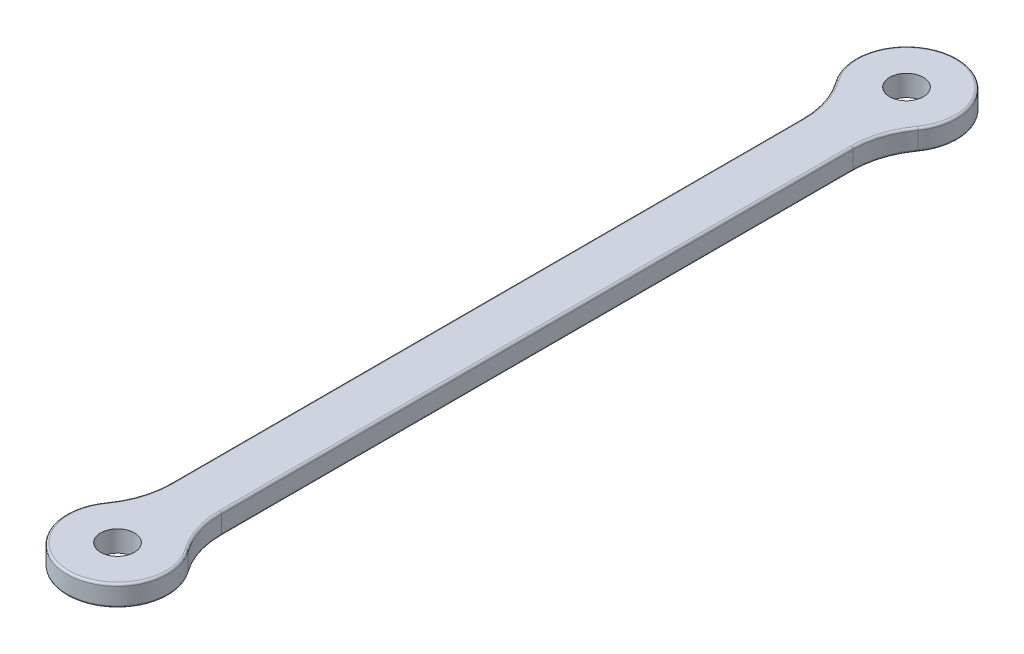
ISO-10303-21;
HEADER;
FILE_DESCRIPTION(('STEP AP214'),'2;1');
FILE_NAME('part.step','',(''),(''),'','','');
FILE_SCHEMA(('AUTOMOTIVE_DESIGN { 1 0 10303 214 1 1 1 1 }'));
ENDSEC;
DATA;
#1=APPLICATION_CONTEXT('core data for automotive mechanical design processes');
#2=APPLICATION_PROTOCOL_DEFINITION('international standard','automotive_design',2000,#1);
#3=PRODUCT_CONTEXT('',#1,'mechanical');
#4=PRODUCT('Part','Part','',(#3));
#5=PRODUCT_RELATED_PRODUCT_CATEGORY('part','',(#4));
#6=PRODUCT_DEFINITION_FORMATION('','',#4);
#7=PRODUCT_DEFINITION_CONTEXT('part definition',#1,'design');
#8=PRODUCT_DEFINITION('design','',#6,#7);
#9=PRODUCT_DEFINITION_SHAPE('','',#8);
#10=(LENGTH_UNIT() NAMED_UNIT(*) SI_UNIT(.MILLI.,.METRE.));
#11=(NAMED_UNIT(*) PLANE_ANGLE_UNIT() SI_UNIT($,.RADIAN.));
#12=(NAMED_UNIT(*) SI_UNIT($,.STERADIAN.) SOLID_ANGLE_UNIT());
#13=UNCERTAINTY_MEASURE_WITH_UNIT(LENGTH_MEASURE(1.E-05),#10,'distance_accuracy_value','');
#14=(GEOMETRIC_REPRESENTATION_CONTEXT(3) GLOBAL_UNCERTAINTY_ASSIGNED_CONTEXT((#13)) GLOBAL_UNIT_ASSIGNED_CONTEXT((#10,
#11,#12)) REPRESENTATION_CONTEXT('',''));
#15=CARTESIAN_POINT('',(0.,0.,0.));
#16=DIRECTION('',(0.,0.,1.));
#17=DIRECTION('',(1.,0.,0.));
#18=AXIS2_PLACEMENT_3D('',#15,#16,#17);
#19=CARTESIAN_POINT('',(0.,2.5,46.75));
#20=DIRECTION('',(0.,-1.,0.));
#21=DIRECTION('',(0.,0.,-1.));
#22=AXIS2_PLACEMENT_3D('',#19,#20,#21);
#23=CYLINDRICAL_SURFACE('',#22,6.);
#24=DIRECTION('',(0.,-1.,0.));
#25=VECTOR('',#24,1.);
#26=CARTESIAN_POINT('',(4.87500000000001,2.5,43.2522328550917));
#27=LINE('',#26,#25);
#28=CARTESIAN_POINT('',(4.87500000000001,0.25,43.2522328550917));
#29=VERTEX_POINT('',#28);
#30=CARTESIAN_POINT('',(4.87500000000001,2.25,43.2522328550917));
#31=VERTEX_POINT('',#30);
#32=EDGE_CURVE('E299',#29,#31,#27,.F.);
#33=ORIENTED_EDGE('',*,*,#32,.T.);
#34=CARTESIAN_POINT('',(0.,2.25,46.75));
#35=DIRECTION('',(0.,1.,0.));
#36=DIRECTION('',(0.,0.,1.));
#37=AXIS2_PLACEMENT_3D('',#34,#35,#36);
#38=CIRCLE('',#37,6.);
#39=CARTESIAN_POINT('',(-4.875,2.25,43.2522328550917));
#40=VERTEX_POINT('',#39);
#41=EDGE_CURVE('E193',#31,#40,#38,.F.);
#42=ORIENTED_EDGE('',*,*,#41,.T.);
#43=DIRECTION('',(0.,-1.,0.));
#44=VECTOR('',#43,1.);
#45=CARTESIAN_POINT('',(-4.875,2.5,43.2522328550917));
#46=LINE('',#45,#44);
#47=CARTESIAN_POINT('',(-4.875,0.25,43.2522328550917));
#48=VERTEX_POINT('',#47);
#49=EDGE_CURVE('E294',#40,#48,#46,.T.);
#50=ORIENTED_EDGE('',*,*,#49,.T.);
#51=CARTESIAN_POINT('',(0.,0.25,46.75));
#52=DIRECTION('',(0.,1.,0.));
#53=DIRECTION('',(0.,0.,1.));
#54=AXIS2_PLACEMENT_3D('',#51,#52,#53);
#55=CIRCLE('',#54,6.);
#56=EDGE_CURVE('E191',#48,#29,#55,.T.);
#57=ORIENTED_EDGE('',*,*,#56,.T.);
#58=EDGE_LOOP('',(#33,#42,#50,#57));
#59=FACE_BOUND('',#58,.T.);
#60=ADVANCED_FACE('F39',(#59),#23,.T.);
#61=CARTESIAN_POINT('',(3.,2.5,0.));
#62=DIRECTION('',(-1.,0.,0.));
#63=DIRECTION('',(0.,0.,1.));
#64=AXIS2_PLACEMENT_3D('',#61,#62,#63);
#65=PLANE('',#64);
#66=DIRECTION('',(0.,1.,0.));
#67=VECTOR('',#66,1.);
#68=CARTESIAN_POINT('',(3.,2.5,-37.4226209469112));
#69=LINE('',#68,#67);
#70=CARTESIAN_POINT('',(3.,0.25,-37.4226209469112));
#71=VERTEX_POINT('',#70);
#72=CARTESIAN_POINT('',(3.,2.25,-37.4226209469112));
#73=VERTEX_POINT('',#72);
#74=EDGE_CURVE('E175',#71,#73,#69,.T.);
#75=ORIENTED_EDGE('',*,*,#74,.T.);
#76=DIRECTION('',(0.,0.,-1.));
#77=VECTOR('',#76,1.);
#78=CARTESIAN_POINT('',(3.,2.25,37.4226209469112));
#79=LINE('',#78,#77);
#80=CARTESIAN_POINT('',(3.,2.25,37.4226209469112));
#81=VERTEX_POINT('',#80);
#82=EDGE_CURVE('E11',#73,#81,#79,.F.);
#83=ORIENTED_EDGE('',*,*,#82,.T.);
#84=DIRECTION('',(0.,1.,0.));
#85=VECTOR('',#84,1.);
#86=CARTESIAN_POINT('',(3.,0.,37.4226209469112));
#87=LINE('',#86,#85);
#88=CARTESIAN_POINT('',(3.,0.25,37.4226209469112));
#89=VERTEX_POINT('',#88);
#90=EDGE_CURVE('E306',#81,#89,#87,.F.);
#91=ORIENTED_EDGE('',*,*,#90,.T.);
#92=DIRECTION('',(0.,0.,-1.));
#93=VECTOR('',#92,1.);
#94=CARTESIAN_POINT('',(3.,0.25,0.));
#95=LINE('',#94,#93);
#96=EDGE_CURVE('E48',#89,#71,#95,.T.);
#97=ORIENTED_EDGE('',*,*,#96,.T.);
#98=EDGE_LOOP('',(#75,#83,#91,#97));
#99=FACE_BOUND('',#98,.T.);
#100=ADVANCED_FACE('F372',(#99),#65,.F.);
#101=CARTESIAN_POINT('',(0.,2.5,-46.75));
#102=DIRECTION('',(0.,-1.,0.));
#103=DIRECTION('',(0.,0.,-1.));
#104=AXIS2_PLACEMENT_3D('',#101,#102,#103);
#105=CYLINDRICAL_SURFACE('',#104,6.);
#106=DIRECTION('',(0.,-1.,0.));
#107=VECTOR('',#106,1.);
#108=CARTESIAN_POINT('',(-4.875,2.5,-43.2522328550917));
#109=LINE('',#108,#107);
#110=CARTESIAN_POINT('',(-4.875,0.25,-43.2522328550917));
#111=VERTEX_POINT('',#110);
#112=CARTESIAN_POINT('',(-4.875,2.25,-43.2522328550917));
#113=VERTEX_POINT('',#112);
#114=EDGE_CURVE('E287',#111,#113,#109,.F.);
#115=ORIENTED_EDGE('',*,*,#114,.T.);
#116=CARTESIAN_POINT('',(0.,2.25,-46.75));
#117=DIRECTION('',(0.,1.,0.));
#118=DIRECTION('',(0.,0.,1.));
#119=AXIS2_PLACEMENT_3D('',#116,#117,#118);
#120=CIRCLE('',#119,6.);
#121=CARTESIAN_POINT('',(4.87500000000001,2.25,-43.2522328550917));
#122=VERTEX_POINT('',#121);
#123=EDGE_CURVE('E209',#113,#122,#120,.F.);
#124=ORIENTED_EDGE('',*,*,#123,.T.);
#125=DIRECTION('',(0.,-1.,0.));
#126=VECTOR('',#125,1.);
#127=CARTESIAN_POINT('',(4.87500000000001,2.5,-43.2522328550917));
#128=LINE('',#127,#126);
#129=CARTESIAN_POINT('',(4.87500000000001,0.25,-43.2522328550917));
#130=VERTEX_POINT('',#129);
#131=EDGE_CURVE('E296',#122,#130,#128,.T.);
#132=ORIENTED_EDGE('',*,*,#131,.T.);
#133=CARTESIAN_POINT('',(0.,0.25,-46.75));
#134=DIRECTION('',(0.,1.,0.));
#135=DIRECTION('',(0.,0.,1.));
#136=AXIS2_PLACEMENT_3D('',#133,#134,#135);
#137=CIRCLE('',#136,6.);
#138=EDGE_CURVE('E207',#130,#111,#137,.T.);
#139=ORIENTED_EDGE('',*,*,#138,.T.);
#140=EDGE_LOOP('',(#115,#124,#132,#139));
#141=FACE_BOUND('',#140,.T.);
#142=ADVANCED_FACE('F377',(#141),#105,.T.);
#143=CARTESIAN_POINT('',(0.,2.5,46.75));
#144=DIRECTION('',(0.,-1.,0.));
#145=DIRECTION('',(0.,0.,-1.));
#146=AXIS2_PLACEMENT_3D('',#143,#144,#145);
#147=CYLINDRICAL_SURFACE('',#146,2.);
#148=CARTESIAN_POINT('',(0.,2.5,46.75));
#149=DIRECTION('',(0.,1.,0.));
#150=DIRECTION('',(0.,0.,1.));
#151=AXIS2_PLACEMENT_3D('',#148,#149,#150);
#152=CIRCLE('',#151,2.);
#153=CARTESIAN_POINT('',(0.,2.5,48.75));
#154=VERTEX_POINT('',#153);
#155=EDGE_CURVE('E337',#154,#154,#152,.T.);
#156=ORIENTED_EDGE('',*,*,#155,.T.);
#157=EDGE_LOOP('',(#156));
#158=FACE_BOUND('',#157,.T.);
#159=CARTESIAN_POINT('',(0.,0.,46.75));
#160=DIRECTION('',(0.,1.,0.));
#161=DIRECTION('',(0.,0.,1.));
#162=AXIS2_PLACEMENT_3D('',#159,#160,#161);
#163=CIRCLE('',#162,2.);
#164=CARTESIAN_POINT('',(0.,0.,48.75));
#165=VERTEX_POINT('',#164);
#166=EDGE_CURVE('E248',#165,#165,#163,.T.);
#167=ORIENTED_EDGE('',*,*,#166,.F.);
#168=EDGE_LOOP('',(#167));
#169=FACE_BOUND('',#168,.T.);
#170=ADVANCED_FACE('F348',(#158,#169),#147,.F.);
#171=CARTESIAN_POINT('',(-3.,2.5,0.));
#172=DIRECTION('',(-1.,0.,0.));
#173=DIRECTION('',(0.,0.,1.));
#174=AXIS2_PLACEMENT_3D('',#171,#172,#173);
#175=PLANE('',#174);
#176=DIRECTION('',(0.,-1.,0.));
#177=VECTOR('',#176,1.);
#178=CARTESIAN_POINT('',(-3.,2.5,37.4226209469112));
#179=LINE('',#178,#177);
#180=CARTESIAN_POINT('',(-3.,0.25,37.4226209469112));
#181=VERTEX_POINT('',#180);
#182=CARTESIAN_POINT('',(-3.,2.25,37.4226209469112));
#183=VERTEX_POINT('',#182);
#184=EDGE_CURVE('E293',#181,#183,#179,.F.);
#185=ORIENTED_EDGE('',*,*,#184,.T.);
#186=DIRECTION('',(0.,0.,-1.));
#187=VECTOR('',#186,1.);
#188=CARTESIAN_POINT('',(-3.,2.25,0.));
#189=LINE('',#188,#187);
#190=CARTESIAN_POINT('',(-3.,2.25,-37.4226209469112));
#191=VERTEX_POINT('',#190);
#192=EDGE_CURVE('E201',#183,#191,#189,.T.);
#193=ORIENTED_EDGE('',*,*,#192,.T.);
#194=DIRECTION('',(0.,-1.,0.));
#195=VECTOR('',#194,1.);
#196=CARTESIAN_POINT('',(-3.,2.5,-37.4226209469112));
#197=LINE('',#196,#195);
#198=CARTESIAN_POINT('',(-3.,0.25,-37.4226209469112));
#199=VERTEX_POINT('',#198);
#200=EDGE_CURVE('E284',#191,#199,#197,.T.);
#201=ORIENTED_EDGE('',*,*,#200,.T.);
#202=DIRECTION('',(0.,0.,-1.));
#203=VECTOR('',#202,1.);
#204=CARTESIAN_POINT('',(-3.,0.25,37.4226209469112));
#205=LINE('',#204,#203);
#206=EDGE_CURVE('E199',#199,#181,#205,.F.);
#207=ORIENTED_EDGE('',*,*,#206,.T.);
#208=EDGE_LOOP('',(#185,#193,#201,#207));
#209=FACE_BOUND('',#208,.T.);
#210=ADVANCED_FACE('F290',(#209),#175,.T.);
#211=CARTESIAN_POINT('',(0.,2.5,-46.75));
#212=DIRECTION('',(0.,-1.,0.));
#213=DIRECTION('',(0.,0.,-1.));
#214=AXIS2_PLACEMENT_3D('',#211,#212,#213);
#215=CYLINDRICAL_SURFACE('',#214,2.);
#216=CARTESIAN_POINT('',(0.,2.5,-46.75));
#217=DIRECTION('',(0.,1.,0.));
#218=DIRECTION('',(0.,0.,1.));
#219=AXIS2_PLACEMENT_3D('',#216,#217,#218);
#220=CIRCLE('',#219,2.);
#221=CARTESIAN_POINT('',(0.,2.5,-44.75));
#222=VERTEX_POINT('',#221);
#223=EDGE_CURVE('E335',#222,#222,#220,.T.);
#224=ORIENTED_EDGE('',*,*,#223,.T.);
#225=EDGE_LOOP('',(#224));
#226=FACE_BOUND('',#225,.T.);
#227=CARTESIAN_POINT('',(0.,0.,-46.75));
#228=DIRECTION('',(0.,1.,0.));
#229=DIRECTION('',(0.,0.,1.));
#230=AXIS2_PLACEMENT_3D('',#227,#228,#229);
#231=CIRCLE('',#230,2.);
#232=CARTESIAN_POINT('',(0.,0.,-44.75));
#233=VERTEX_POINT('',#232);
#234=EDGE_CURVE('E340',#233,#233,#231,.T.);
#235=ORIENTED_EDGE('',*,*,#234,.F.);
#236=EDGE_LOOP('',(#235));
#237=FACE_BOUND('',#236,.T.);
#238=ADVANCED_FACE('F353',(#226,#237),#215,.F.);
#239=CARTESIAN_POINT('',(0.,2.5,0.));
#240=DIRECTION('',(0.,1.,0.));
#241=DIRECTION('',(0.,0.,1.));
#242=AXIS2_PLACEMENT_3D('',#239,#240,#241);
#243=PLANE('',#242);
#244=CARTESIAN_POINT('',(0.,2.5,46.75));
#245=DIRECTION('',(0.,1.,0.));
#246=DIRECTION('',(0.,0.,1.));
#247=AXIS2_PLACEMENT_3D('',#244,#245,#246);
#248=CIRCLE('',#247,5.75);
#249=CARTESIAN_POINT('',(-4.671875,2.5,43.3979731527962));
#250=VERTEX_POINT('',#249);
#251=CARTESIAN_POINT('',(4.67187500000001,2.5,43.3979731527962));
#252=VERTEX_POINT('',#251);
#253=EDGE_CURVE('E180',#250,#252,#248,.T.);
#254=ORIENTED_EDGE('',*,*,#253,.T.);
#255=CARTESIAN_POINT('',(13.,2.5,37.4226209469112));
#256=DIRECTION('',(0.,1.,0.));
#257=DIRECTION('',(0.,0.,1.));
#258=AXIS2_PLACEMENT_3D('',#255,#256,#257);
#259=CIRCLE('',#258,10.25);
#260=CARTESIAN_POINT('',(2.75,2.5,37.4226209469112));
#261=VERTEX_POINT('',#260);
#262=EDGE_CURVE('E160',#252,#261,#259,.F.);
#263=ORIENTED_EDGE('',*,*,#262,.T.);
#264=DIRECTION('',(0.,0.,-1.));
#265=VECTOR('',#264,1.);
#266=CARTESIAN_POINT('',(2.75,2.5,-37.4226209469112));
#267=LINE('',#266,#265);
#268=CARTESIAN_POINT('',(2.75,2.5,-37.4226209469112));
#269=VERTEX_POINT('',#268);
#270=EDGE_CURVE('E168',#261,#269,#267,.T.);
#271=ORIENTED_EDGE('',*,*,#270,.T.);
#272=CARTESIAN_POINT('',(13.,2.5,-37.4226209469112));
#273=DIRECTION('',(0.,1.,0.));
#274=DIRECTION('',(0.,0.,1.));
#275=AXIS2_PLACEMENT_3D('',#272,#273,#274);
#276=CIRCLE('',#275,10.25);
#277=CARTESIAN_POINT('',(4.67187500000001,2.5,-43.3979731527962));
#278=VERTEX_POINT('',#277);
#279=EDGE_CURVE('E174',#269,#278,#276,.F.);
#280=ORIENTED_EDGE('',*,*,#279,.T.);
#281=CARTESIAN_POINT('',(0.,2.5,-46.75));
#282=DIRECTION('',(0.,1.,0.));
#283=DIRECTION('',(0.,0.,1.));
#284=AXIS2_PLACEMENT_3D('',#281,#282,#283);
#285=CIRCLE('',#284,5.75);
#286=CARTESIAN_POINT('',(-4.671875,2.5,-43.3979731527962));
#287=VERTEX_POINT('',#286);
#288=EDGE_CURVE('E312',#278,#287,#285,.T.);
#289=ORIENTED_EDGE('',*,*,#288,.T.);
#290=CARTESIAN_POINT('',(-13.,2.5,-37.4226209469112));
#291=DIRECTION('',(0.,1.,0.));
#292=DIRECTION('',(0.,0.,1.));
#293=AXIS2_PLACEMENT_3D('',#290,#291,#292);
#294=CIRCLE('',#293,10.25);
#295=CARTESIAN_POINT('',(-2.75,2.5,-37.4226209469112));
#296=VERTEX_POINT('',#295);
#297=EDGE_CURVE('E314',#287,#296,#294,.F.);
#298=ORIENTED_EDGE('',*,*,#297,.T.);
#299=DIRECTION('',(0.,0.,-1.));
#300=VECTOR('',#299,1.);
#301=CARTESIAN_POINT('',(-2.75,2.5,0.));
#302=LINE('',#301,#300);
#303=CARTESIAN_POINT('',(-2.75,2.5,37.4226209469112));
#304=VERTEX_POINT('',#303);
#305=EDGE_CURVE('E316',#296,#304,#302,.F.);
#306=ORIENTED_EDGE('',*,*,#305,.T.);
#307=CARTESIAN_POINT('',(-13.,2.5,37.4226209469112));
#308=DIRECTION('',(0.,1.,0.));
#309=DIRECTION('',(0.,0.,1.));
#310=AXIS2_PLACEMENT_3D('',#307,#308,#309);
#311=CIRCLE('',#310,10.25);
#312=EDGE_CURVE('E186',#304,#250,#311,.F.);
#313=ORIENTED_EDGE('',*,*,#312,.T.);
#314=EDGE_LOOP('',(#254,#263,#271,#280,#289,#298,#306,#313));
#315=FACE_BOUND('',#314,.T.);
#316=ORIENTED_EDGE('',*,*,#155,.F.);
#317=EDGE_LOOP('',(#316));
#318=FACE_BOUND('',#317,.T.);
#319=ORIENTED_EDGE('',*,*,#223,.F.);
#320=EDGE_LOOP('',(#319));
#321=FACE_BOUND('',#320,.T.);
#322=ADVANCED_FACE('F177',(#315,#318,#321),#243,.T.);
#323=CARTESIAN_POINT('',(0.,0.,0.));
#324=DIRECTION('',(0.,1.,0.));
#325=DIRECTION('',(0.,0.,1.));
#326=AXIS2_PLACEMENT_3D('',#323,#324,#325);
#327=PLANE('',#326);
#328=DIRECTION('',(0.,0.,-1.));
#329=VECTOR('',#328,1.);
#330=CARTESIAN_POINT('',(2.75,0.,0.));
#331=LINE('',#330,#329);
#332=CARTESIAN_POINT('',(2.75,0.,-37.4226209469112));
#333=VERTEX_POINT('',#332);
#334=CARTESIAN_POINT('',(2.75,0.,37.4226209469112));
#335=VERTEX_POINT('',#334);
#336=EDGE_CURVE('E215',#333,#335,#331,.F.);
#337=ORIENTED_EDGE('',*,*,#336,.T.);
#338=CARTESIAN_POINT('',(13.,0.,37.4226209469112));
#339=DIRECTION('',(0.,1.,0.));
#340=DIRECTION('',(0.,0.,1.));
#341=AXIS2_PLACEMENT_3D('',#338,#339,#340);
#342=CIRCLE('',#341,10.25);
#343=CARTESIAN_POINT('',(4.67187500000001,0.,43.3979731527962));
#344=VERTEX_POINT('',#343);
#345=EDGE_CURVE('E228',#335,#344,#342,.T.);
#346=ORIENTED_EDGE('',*,*,#345,.T.);
#347=CARTESIAN_POINT('',(0.,0.,46.75));
#348=DIRECTION('',(0.,1.,0.));
#349=DIRECTION('',(0.,0.,1.));
#350=AXIS2_PLACEMENT_3D('',#347,#348,#349);
#351=CIRCLE('',#350,5.75);
#352=CARTESIAN_POINT('',(-4.671875,0.,43.3979731527962));
#353=VERTEX_POINT('',#352);
#354=EDGE_CURVE('E63',#344,#353,#351,.F.);
#355=ORIENTED_EDGE('',*,*,#354,.T.);
#356=CARTESIAN_POINT('',(-13.,0.,37.4226209469112));
#357=DIRECTION('',(0.,1.,0.));
#358=DIRECTION('',(0.,0.,1.));
#359=AXIS2_PLACEMENT_3D('',#356,#357,#358);
#360=CIRCLE('',#359,10.25);
#361=CARTESIAN_POINT('',(-2.75,0.,37.4226209469112));
#362=VERTEX_POINT('',#361);
#363=EDGE_CURVE('E225',#353,#362,#360,.T.);
#364=ORIENTED_EDGE('',*,*,#363,.T.);
#365=DIRECTION('',(0.,0.,-1.));
#366=VECTOR('',#365,1.);
#367=CARTESIAN_POINT('',(-2.75,0.,-37.4226209469112));
#368=LINE('',#367,#366);
#369=CARTESIAN_POINT('',(-2.75,0.,-37.4226209469112));
#370=VERTEX_POINT('',#369);
#371=EDGE_CURVE('E223',#362,#370,#368,.T.);
#372=ORIENTED_EDGE('',*,*,#371,.T.);
#373=CARTESIAN_POINT('',(-13.,0.,-37.4226209469112));
#374=DIRECTION('',(0.,1.,0.));
#375=DIRECTION('',(0.,0.,1.));
#376=AXIS2_PLACEMENT_3D('',#373,#374,#375);
#377=CIRCLE('',#376,10.25);
#378=CARTESIAN_POINT('',(-4.671875,0.,-43.3979731527962));
#379=VERTEX_POINT('',#378);
#380=EDGE_CURVE('E221',#370,#379,#377,.T.);
#381=ORIENTED_EDGE('',*,*,#380,.T.);
#382=CARTESIAN_POINT('',(0.,0.,-46.75));
#383=DIRECTION('',(0.,1.,0.));
#384=DIRECTION('',(0.,0.,1.));
#385=AXIS2_PLACEMENT_3D('',#382,#383,#384);
#386=CIRCLE('',#385,5.75);
#387=CARTESIAN_POINT('',(4.67187500000001,0.,-43.3979731527962));
#388=VERTEX_POINT('',#387);
#389=EDGE_CURVE('E219',#379,#388,#386,.F.);
#390=ORIENTED_EDGE('',*,*,#389,.T.);
#391=CARTESIAN_POINT('',(13.,0.,-37.4226209469112));
#392=DIRECTION('',(0.,1.,0.));
#393=DIRECTION('',(0.,0.,1.));
#394=AXIS2_PLACEMENT_3D('',#391,#392,#393);
#395=CIRCLE('',#394,10.25);
#396=EDGE_CURVE('E217',#388,#333,#395,.T.);
#397=ORIENTED_EDGE('',*,*,#396,.T.);
#398=EDGE_LOOP('',(#337,#346,#355,#364,#372,#381,#390,#397));
#399=FACE_BOUND('',#398,.T.);
#400=ORIENTED_EDGE('',*,*,#166,.T.);
#401=EDGE_LOOP('',(#400));
#402=FACE_BOUND('',#401,.T.);
#403=ORIENTED_EDGE('',*,*,#234,.T.);
#404=EDGE_LOOP('',(#403));
#405=FACE_BOUND('',#404,.T.);
#406=ADVANCED_FACE('F352',(#399,#402,#405),#327,.F.);
#407=CARTESIAN_POINT('',(-13.,2.5,37.4226209469112));
#408=DIRECTION('',(0.,-1.,0.));
#409=DIRECTION('',(0.,0.,-1.));
#410=AXIS2_PLACEMENT_3D('',#407,#408,#409);
#411=CYLINDRICAL_SURFACE('',#410,10.);
#412=ORIENTED_EDGE('',*,*,#49,.F.);
#413=CARTESIAN_POINT('',(-13.,2.25,37.4226209469112));
#414=DIRECTION('',(0.,1.,0.));
#415=DIRECTION('',(0.,0.,1.));
#416=AXIS2_PLACEMENT_3D('',#413,#414,#415);
#417=CIRCLE('',#416,10.);
#418=EDGE_CURVE('E197',#40,#183,#417,.T.);
#419=ORIENTED_EDGE('',*,*,#418,.T.);
#420=ORIENTED_EDGE('',*,*,#184,.F.);
#421=CARTESIAN_POINT('',(-13.,0.25,37.4226209469112));
#422=DIRECTION('',(0.,1.,0.));
#423=DIRECTION('',(0.,0.,1.));
#424=AXIS2_PLACEMENT_3D('',#421,#422,#423);
#425=CIRCLE('',#424,10.);
#426=EDGE_CURVE('E195',#181,#48,#425,.F.);
#427=ORIENTED_EDGE('',*,*,#426,.T.);
#428=EDGE_LOOP('',(#412,#419,#420,#427));
#429=FACE_BOUND('',#428,.T.);
#430=ADVANCED_FACE('F363',(#429),#411,.F.);
#431=CARTESIAN_POINT('',(-13.,2.5,-37.4226209469112));
#432=DIRECTION('',(0.,-1.,0.));
#433=DIRECTION('',(0.,0.,-1.));
#434=AXIS2_PLACEMENT_3D('',#431,#432,#433);
#435=CYLINDRICAL_SURFACE('',#434,10.);
#436=ORIENTED_EDGE('',*,*,#200,.F.);
#437=CARTESIAN_POINT('',(-13.,2.25,-37.4226209469112));
#438=DIRECTION('',(0.,1.,0.));
#439=DIRECTION('',(0.,0.,1.));
#440=AXIS2_PLACEMENT_3D('',#437,#438,#439);
#441=CIRCLE('',#440,10.);
#442=EDGE_CURVE('E205',#191,#113,#441,.T.);
#443=ORIENTED_EDGE('',*,*,#442,.T.);
#444=ORIENTED_EDGE('',*,*,#114,.F.);
#445=CARTESIAN_POINT('',(-13.,0.25,-37.4226209469112));
#446=DIRECTION('',(0.,1.,0.));
#447=DIRECTION('',(0.,0.,1.));
#448=AXIS2_PLACEMENT_3D('',#445,#446,#447);
#449=CIRCLE('',#448,10.);
#450=EDGE_CURVE('E203',#111,#199,#449,.F.);
#451=ORIENTED_EDGE('',*,*,#450,.T.);
#452=EDGE_LOOP('',(#436,#443,#444,#451));
#453=FACE_BOUND('',#452,.T.);
#454=ADVANCED_FACE('F283',(#453),#435,.F.);
#455=CARTESIAN_POINT('',(13.,2.5,-37.4226209469112));
#456=DIRECTION('',(0.,-1.,0.));
#457=DIRECTION('',(0.,0.,-1.));
#458=AXIS2_PLACEMENT_3D('',#455,#456,#457);
#459=CYLINDRICAL_SURFACE('',#458,10.);
#460=ORIENTED_EDGE('',*,*,#131,.F.);
#461=CARTESIAN_POINT('',(13.,2.25,-37.4226209469112));
#462=DIRECTION('',(0.,1.,0.));
#463=DIRECTION('',(0.,0.,1.));
#464=AXIS2_PLACEMENT_3D('',#461,#462,#463);
#465=CIRCLE('',#464,10.);
#466=EDGE_CURVE('E213',#122,#73,#465,.T.);
#467=ORIENTED_EDGE('',*,*,#466,.T.);
#468=ORIENTED_EDGE('',*,*,#74,.F.);
#469=CARTESIAN_POINT('',(13.,0.25,-37.4226209469112));
#470=DIRECTION('',(0.,1.,0.));
#471=DIRECTION('',(0.,0.,1.));
#472=AXIS2_PLACEMENT_3D('',#469,#470,#471);
#473=CIRCLE('',#472,10.);
#474=EDGE_CURVE('E211',#71,#130,#473,.F.);
#475=ORIENTED_EDGE('',*,*,#474,.T.);
#476=EDGE_LOOP('',(#460,#467,#468,#475));
#477=FACE_BOUND('',#476,.T.);
#478=ADVANCED_FACE('F384',(#477),#459,.F.);
#479=CARTESIAN_POINT('',(13.,2.5,37.4226209469112));
#480=DIRECTION('',(0.,-1.,0.));
#481=DIRECTION('',(0.,0.,-1.));
#482=AXIS2_PLACEMENT_3D('',#479,#480,#481);
#483=CYLINDRICAL_SURFACE('',#482,10.);
#484=ORIENTED_EDGE('',*,*,#90,.F.);
#485=CARTESIAN_POINT('',(13.,2.25,37.4226209469112));
#486=DIRECTION('',(0.,1.,0.));
#487=DIRECTION('',(0.,0.,1.));
#488=AXIS2_PLACEMENT_3D('',#485,#486,#487);
#489=CIRCLE('',#488,10.);
#490=EDGE_CURVE('E162',#81,#31,#489,.T.);
#491=ORIENTED_EDGE('',*,*,#490,.T.);
#492=ORIENTED_EDGE('',*,*,#32,.F.);
#493=CARTESIAN_POINT('',(13.,0.25,37.4226209469112));
#494=DIRECTION('',(0.,1.,0.));
#495=DIRECTION('',(0.,0.,1.));
#496=AXIS2_PLACEMENT_3D('',#493,#494,#495);
#497=CIRCLE('',#496,10.);
#498=EDGE_CURVE('E182',#29,#89,#497,.F.);
#499=ORIENTED_EDGE('',*,*,#498,.T.);
#500=EDGE_LOOP('',(#484,#491,#492,#499));
#501=FACE_BOUND('',#500,.T.);
#502=ADVANCED_FACE('F333',(#501),#483,.F.);
#503=CARTESIAN_POINT('',(-13.,2.25,-37.4226209469112));
#504=DIRECTION('',(0.,1.,0.));
#505=DIRECTION('',(0.,0.,1.));
#506=AXIS2_PLACEMENT_3D('',#503,#504,#505);
#507=TOROIDAL_SURFACE('',#506,10.25,0.25);
#508=CARTESIAN_POINT('',(-4.67187499999999,2.25,-43.3979731527962));
#509=DIRECTION('',(-0.582961190818049,0.,-0.812500000000001));
#510=DIRECTION('',(-0.812500000000001,0.,0.582961190818049));
#511=AXIS2_PLACEMENT_3D('',#508,#509,#510);
#512=CIRCLE('',#511,0.25);
#513=EDGE_CURVE('E242',#113,#287,#512,.T.);
#514=ORIENTED_EDGE('',*,*,#513,.F.);
#515=ORIENTED_EDGE('',*,*,#442,.F.);
#516=CARTESIAN_POINT('',(-2.75,2.25,-37.4226209469112));
#517=DIRECTION('',(0.,0.,1.));
#518=DIRECTION('',(1.,0.,0.));
#519=AXIS2_PLACEMENT_3D('',#516,#517,#518);
#520=CIRCLE('',#519,0.25);
#521=EDGE_CURVE('E245',#296,#191,#520,.T.);
#522=ORIENTED_EDGE('',*,*,#521,.F.);
#523=ORIENTED_EDGE('',*,*,#297,.F.);
#524=EDGE_LOOP('',(#514,#515,#522,#523));
#525=FACE_BOUND('',#524,.T.);
#526=ADVANCED_FACE('F390',(#525),#507,.T.);
#527=CARTESIAN_POINT('',(-2.75,2.25,0.));
#528=DIRECTION('',(0.,0.,-1.));
#529=DIRECTION('',(-1.,0.,0.));
#530=AXIS2_PLACEMENT_3D('',#527,#528,#529);
#531=CYLINDRICAL_SURFACE('',#530,0.25);
#532=ORIENTED_EDGE('',*,*,#521,.T.);
#533=ORIENTED_EDGE('',*,*,#192,.F.);
#534=CARTESIAN_POINT('',(-2.75,2.25,37.4226209469112));
#535=DIRECTION('',(0.,0.,1.));
#536=DIRECTION('',(1.,0.,0.));
#537=AXIS2_PLACEMENT_3D('',#534,#535,#536);
#538=CIRCLE('',#537,0.25);
#539=EDGE_CURVE('E239',#304,#183,#538,.T.);
#540=ORIENTED_EDGE('',*,*,#539,.F.);
#541=ORIENTED_EDGE('',*,*,#305,.F.);
#542=EDGE_LOOP('',(#532,#533,#540,#541));
#543=FACE_BOUND('',#542,.T.);
#544=ADVANCED_FACE('F406',(#543),#531,.T.);
#545=CARTESIAN_POINT('',(0.,2.25,-46.75));
#546=DIRECTION('',(0.,1.,0.));
#547=DIRECTION('',(0.,0.,1.));
#548=AXIS2_PLACEMENT_3D('',#545,#546,#547);
#549=TOROIDAL_SURFACE('',#548,5.75,0.25);
#550=ORIENTED_EDGE('',*,*,#513,.T.);
#551=ORIENTED_EDGE('',*,*,#288,.F.);
#552=CARTESIAN_POINT('',(4.67187500000001,2.25,-43.3979731527962));
#553=DIRECTION('',(-0.582961190818049,0.,0.812500000000001));
#554=DIRECTION('',(0.812500000000001,0.,0.582961190818049));
#555=AXIS2_PLACEMENT_3D('',#552,#553,#554);
#556=CIRCLE('',#555,0.25);
#557=EDGE_CURVE('E236',#122,#278,#556,.T.);
#558=ORIENTED_EDGE('',*,*,#557,.F.);
#559=ORIENTED_EDGE('',*,*,#123,.F.);
#560=EDGE_LOOP('',(#550,#551,#558,#559));
#561=FACE_BOUND('',#560,.T.);
#562=ADVANCED_FACE('F403',(#561),#549,.T.);
#563=CARTESIAN_POINT('',(-13.,2.25,37.4226209469112));
#564=DIRECTION('',(0.,1.,0.));
#565=DIRECTION('',(0.,0.,1.));
#566=AXIS2_PLACEMENT_3D('',#563,#564,#565);
#567=TOROIDAL_SURFACE('',#566,10.25,0.25);
#568=ORIENTED_EDGE('',*,*,#539,.T.);
#569=ORIENTED_EDGE('',*,*,#418,.F.);
#570=CARTESIAN_POINT('',(-4.671875,2.25,43.3979731527962));
#571=DIRECTION('',(-0.582961190818052,0.,0.812499999999999));
#572=DIRECTION('',(0.812499999999999,0.,0.582961190818052));
#573=AXIS2_PLACEMENT_3D('',#570,#571,#572);
#574=CIRCLE('',#573,0.25);
#575=EDGE_CURVE('E233',#250,#40,#574,.T.);
#576=ORIENTED_EDGE('',*,*,#575,.F.);
#577=ORIENTED_EDGE('',*,*,#312,.F.);
#578=EDGE_LOOP('',(#568,#569,#576,#577));
#579=FACE_BOUND('',#578,.T.);
#580=ADVANCED_FACE('F323',(#579),#567,.T.);
#581=CARTESIAN_POINT('',(13.,2.25,-37.4226209469112));
#582=DIRECTION('',(0.,1.,0.));
#583=DIRECTION('',(0.,0.,1.));
#584=AXIS2_PLACEMENT_3D('',#581,#582,#583);
#585=TOROIDAL_SURFACE('',#584,10.25,0.25);
#586=ORIENTED_EDGE('',*,*,#557,.T.);
#587=ORIENTED_EDGE('',*,*,#279,.F.);
#588=CARTESIAN_POINT('',(2.75,2.25,-37.4226209469112));
#589=DIRECTION('',(0.,0.,1.));
#590=DIRECTION('',(1.,0.,0.));
#591=AXIS2_PLACEMENT_3D('',#588,#589,#590);
#592=CIRCLE('',#591,0.25);
#593=EDGE_CURVE('E171',#73,#269,#592,.T.);
#594=ORIENTED_EDGE('',*,*,#593,.F.);
#595=ORIENTED_EDGE('',*,*,#466,.F.);
#596=EDGE_LOOP('',(#586,#587,#594,#595));
#597=FACE_BOUND('',#596,.T.);
#598=ADVANCED_FACE('F397',(#597),#585,.T.);
#599=CARTESIAN_POINT('',(0.,2.25,46.75));
#600=DIRECTION('',(0.,1.,0.));
#601=DIRECTION('',(0.,0.,1.));
#602=AXIS2_PLACEMENT_3D('',#599,#600,#601);
#603=TOROIDAL_SURFACE('',#602,5.75,0.25);
#604=ORIENTED_EDGE('',*,*,#575,.T.);
#605=ORIENTED_EDGE('',*,*,#41,.F.);
#606=CARTESIAN_POINT('',(4.67187500000001,2.25,43.3979731527962));
#607=DIRECTION('',(-0.582961190818049,0.,-0.812500000000001));
#608=DIRECTION('',(-0.812500000000001,0.,0.582961190818049));
#609=AXIS2_PLACEMENT_3D('',#606,#607,#608);
#610=CIRCLE('',#609,0.25);
#611=EDGE_CURVE('E165',#252,#31,#610,.T.);
#612=ORIENTED_EDGE('',*,*,#611,.F.);
#613=ORIENTED_EDGE('',*,*,#253,.F.);
#614=EDGE_LOOP('',(#604,#605,#612,#613));
#615=FACE_BOUND('',#614,.T.);
#616=ADVANCED_FACE('F326',(#615),#603,.T.);
#617=CARTESIAN_POINT('',(2.75,2.25,0.));
#618=DIRECTION('',(0.,0.,1.));
#619=DIRECTION('',(1.,0.,0.));
#620=AXIS2_PLACEMENT_3D('',#617,#618,#619);
#621=CYLINDRICAL_SURFACE('',#620,0.25);
#622=ORIENTED_EDGE('',*,*,#593,.T.);
#623=ORIENTED_EDGE('',*,*,#270,.F.);
#624=CARTESIAN_POINT('',(2.75,2.25,37.4226209469112));
#625=DIRECTION('',(0.,0.,1.));
#626=DIRECTION('',(1.,0.,0.));
#627=AXIS2_PLACEMENT_3D('',#624,#625,#626);
#628=CIRCLE('',#627,0.25);
#629=EDGE_CURVE('E156',#81,#261,#628,.T.);
#630=ORIENTED_EDGE('',*,*,#629,.F.);
#631=ORIENTED_EDGE('',*,*,#82,.F.);
#632=EDGE_LOOP('',(#622,#623,#630,#631));
#633=FACE_BOUND('',#632,.T.);
#634=ADVANCED_FACE('F169',(#633),#621,.T.);
#635=CARTESIAN_POINT('',(13.,2.25,37.4226209469112));
#636=DIRECTION('',(0.,1.,0.));
#637=DIRECTION('',(0.,0.,1.));
#638=AXIS2_PLACEMENT_3D('',#635,#636,#637);
#639=TOROIDAL_SURFACE('',#638,10.25,0.25);
#640=ORIENTED_EDGE('',*,*,#611,.T.);
#641=ORIENTED_EDGE('',*,*,#490,.F.);
#642=ORIENTED_EDGE('',*,*,#629,.T.);
#643=ORIENTED_EDGE('',*,*,#262,.F.);
#644=EDGE_LOOP('',(#640,#641,#642,#643));
#645=FACE_BOUND('',#644,.T.);
#646=ADVANCED_FACE('F158',(#645),#639,.T.);
#647=CARTESIAN_POINT('',(-13.,0.25,-37.4226209469112));
#648=DIRECTION('',(0.,1.,0.));
#649=DIRECTION('',(0.,0.,1.));
#650=AXIS2_PLACEMENT_3D('',#647,#648,#649);
#651=TOROIDAL_SURFACE('',#650,10.25,0.25);
#652=CARTESIAN_POINT('',(-2.75,0.25,-37.4226209469112));
#653=DIRECTION('',(0.,0.,1.));
#654=DIRECTION('',(1.,0.,0.));
#655=AXIS2_PLACEMENT_3D('',#652,#653,#654);
#656=CIRCLE('',#655,0.25);
#657=EDGE_CURVE('E263',#199,#370,#656,.T.);
#658=ORIENTED_EDGE('',*,*,#657,.F.);
#659=ORIENTED_EDGE('',*,*,#450,.F.);
#660=CARTESIAN_POINT('',(-4.671875,0.25,-43.3979731527962));
#661=DIRECTION('',(-0.582961190818052,0.,-0.812499999999999));
#662=DIRECTION('',(-0.812499999999999,0.,0.582961190818052));
#663=AXIS2_PLACEMENT_3D('',#660,#661,#662);
#664=CIRCLE('',#663,0.25);
#665=EDGE_CURVE('E43',#379,#111,#664,.T.);
#666=ORIENTED_EDGE('',*,*,#665,.F.);
#667=ORIENTED_EDGE('',*,*,#380,.F.);
#668=EDGE_LOOP('',(#658,#659,#666,#667));
#669=FACE_BOUND('',#668,.T.);
#670=ADVANCED_FACE('F41',(#669),#651,.T.);
#671=CARTESIAN_POINT('',(0.,0.25,-46.75));
#672=DIRECTION('',(0.,1.,0.));
#673=DIRECTION('',(0.,0.,1.));
#674=AXIS2_PLACEMENT_3D('',#671,#672,#673);
#675=TOROIDAL_SURFACE('',#674,5.75,0.25);
#676=ORIENTED_EDGE('',*,*,#665,.T.);
#677=ORIENTED_EDGE('',*,*,#138,.F.);
#678=CARTESIAN_POINT('',(4.67187500000001,0.25,-43.3979731527962));
#679=DIRECTION('',(-0.582961190818049,0.,0.812500000000001));
#680=DIRECTION('',(0.812500000000001,0.,0.582961190818049));
#681=AXIS2_PLACEMENT_3D('',#678,#679,#680);
#682=CIRCLE('',#681,0.25);
#683=EDGE_CURVE('E261',#388,#130,#682,.T.);
#684=ORIENTED_EDGE('',*,*,#683,.F.);
#685=ORIENTED_EDGE('',*,*,#389,.F.);
#686=EDGE_LOOP('',(#676,#677,#684,#685));
#687=FACE_BOUND('',#686,.T.);
#688=ADVANCED_FACE('F274',(#687),#675,.T.);
#689=CARTESIAN_POINT('',(-2.75,0.25,0.));
#690=DIRECTION('',(0.,0.,1.));
#691=DIRECTION('',(1.,0.,0.));
#692=AXIS2_PLACEMENT_3D('',#689,#690,#691);
#693=CYLINDRICAL_SURFACE('',#692,0.25);
#694=ORIENTED_EDGE('',*,*,#657,.T.);
#695=ORIENTED_EDGE('',*,*,#371,.F.);
#696=CARTESIAN_POINT('',(-2.75,0.25,37.4226209469112));
#697=DIRECTION('',(0.,0.,1.));
#698=DIRECTION('',(1.,0.,0.));
#699=AXIS2_PLACEMENT_3D('',#696,#697,#698);
#700=CIRCLE('',#699,0.25);
#701=EDGE_CURVE('E258',#181,#362,#700,.T.);
#702=ORIENTED_EDGE('',*,*,#701,.F.);
#703=ORIENTED_EDGE('',*,*,#206,.F.);
#704=EDGE_LOOP('',(#694,#695,#702,#703));
#705=FACE_BOUND('',#704,.T.);
#706=ADVANCED_FACE('F432',(#705),#693,.T.);
#707=CARTESIAN_POINT('',(13.,0.25,-37.4226209469112));
#708=DIRECTION('',(0.,1.,0.));
#709=DIRECTION('',(0.,0.,1.));
#710=AXIS2_PLACEMENT_3D('',#707,#708,#709);
#711=TOROIDAL_SURFACE('',#710,10.25,0.25);
#712=ORIENTED_EDGE('',*,*,#683,.T.);
#713=ORIENTED_EDGE('',*,*,#474,.F.);
#714=CARTESIAN_POINT('',(2.75,0.25,-37.4226209469112));
#715=DIRECTION('',(0.,0.,1.));
#716=DIRECTION('',(1.,0.,0.));
#717=AXIS2_PLACEMENT_3D('',#714,#715,#716);
#718=CIRCLE('',#717,0.25);
#719=EDGE_CURVE('E255',#333,#71,#718,.T.);
#720=ORIENTED_EDGE('',*,*,#719,.F.);
#721=ORIENTED_EDGE('',*,*,#396,.F.);
#722=EDGE_LOOP('',(#712,#713,#720,#721));
#723=FACE_BOUND('',#722,.T.);
#724=ADVANCED_FACE('F428',(#723),#711,.T.);
#725=CARTESIAN_POINT('',(-13.,0.25,37.4226209469112));
#726=DIRECTION('',(0.,1.,0.));
#727=DIRECTION('',(0.,0.,1.));
#728=AXIS2_PLACEMENT_3D('',#725,#726,#727);
#729=TOROIDAL_SURFACE('',#728,10.25,0.25);
#730=ORIENTED_EDGE('',*,*,#701,.T.);
#731=ORIENTED_EDGE('',*,*,#363,.F.);
#732=CARTESIAN_POINT('',(-4.67187499999999,0.25,43.3979731527962));
#733=DIRECTION('',(-0.582961190818049,0.,0.812500000000001));
#734=DIRECTION('',(0.812500000000001,0.,0.582961190818049));
#735=AXIS2_PLACEMENT_3D('',#732,#733,#734);
#736=CIRCLE('',#735,0.25);
#737=EDGE_CURVE('E252',#48,#353,#736,.T.);
#738=ORIENTED_EDGE('',*,*,#737,.F.);
#739=ORIENTED_EDGE('',*,*,#426,.F.);
#740=EDGE_LOOP('',(#730,#731,#738,#739));
#741=FACE_BOUND('',#740,.T.);
#742=ADVANCED_FACE('F424',(#741),#729,.T.);
#743=CARTESIAN_POINT('',(2.75,0.25,0.));
#744=DIRECTION('',(0.,0.,-1.));
#745=DIRECTION('',(-1.,0.,0.));
#746=AXIS2_PLACEMENT_3D('',#743,#744,#745);
#747=CYLINDRICAL_SURFACE('',#746,0.25);
#748=ORIENTED_EDGE('',*,*,#719,.T.);
#749=ORIENTED_EDGE('',*,*,#96,.F.);
#750=CARTESIAN_POINT('',(2.75,0.25,37.4226209469112));
#751=DIRECTION('',(0.,0.,1.));
#752=DIRECTION('',(1.,0.,0.));
#753=AXIS2_PLACEMENT_3D('',#750,#751,#752);
#754=CIRCLE('',#753,0.25);
#755=EDGE_CURVE('E250',#335,#89,#754,.T.);
#756=ORIENTED_EDGE('',*,*,#755,.F.);
#757=ORIENTED_EDGE('',*,*,#336,.F.);
#758=EDGE_LOOP('',(#748,#749,#756,#757));
#759=FACE_BOUND('',#758,.T.);
#760=ADVANCED_FACE('F420',(#759),#747,.T.);
#761=CARTESIAN_POINT('',(0.,0.25,46.75));
#762=DIRECTION('',(0.,1.,0.));
#763=DIRECTION('',(0.,0.,1.));
#764=AXIS2_PLACEMENT_3D('',#761,#762,#763);
#765=TOROIDAL_SURFACE('',#764,5.75,0.25);
#766=ORIENTED_EDGE('',*,*,#737,.T.);
#767=ORIENTED_EDGE('',*,*,#354,.F.);
#768=CARTESIAN_POINT('',(4.67187500000001,0.25,43.3979731527962));
#769=DIRECTION('',(-0.582961190818049,0.,-0.812500000000001));
#770=DIRECTION('',(-0.812500000000001,0.,0.582961190818049));
#771=AXIS2_PLACEMENT_3D('',#768,#769,#770);
#772=CIRCLE('',#771,0.25);
#773=EDGE_CURVE('E56',#29,#344,#772,.T.);
#774=ORIENTED_EDGE('',*,*,#773,.F.);
#775=ORIENTED_EDGE('',*,*,#56,.F.);
#776=EDGE_LOOP('',(#766,#767,#774,#775));
#777=FACE_BOUND('',#776,.T.);
#778=ADVANCED_FACE('F417',(#777),#765,.T.);
#779=CARTESIAN_POINT('',(13.,0.25,37.4226209469112));
#780=DIRECTION('',(0.,1.,0.));
#781=DIRECTION('',(0.,0.,1.));
#782=AXIS2_PLACEMENT_3D('',#779,#780,#781);
#783=TOROIDAL_SURFACE('',#782,10.25,0.25);
#784=ORIENTED_EDGE('',*,*,#755,.T.);
#785=ORIENTED_EDGE('',*,*,#498,.F.);
#786=ORIENTED_EDGE('',*,*,#773,.T.);
#787=ORIENTED_EDGE('',*,*,#345,.F.);
#788=EDGE_LOOP('',(#784,#785,#786,#787));
#789=FACE_BOUND('',#788,.T.);
#790=ADVANCED_FACE('F414',(#789),#783,.T.);
#791=CLOSED_SHELL('',(#60,#100,#142,#170,#210,#238,#322,#406,#430,#454,#478,#502,#526,#544,#562,
#580,#598,#616,#634,#646,#670,#688,#706,#724,#742,#760,#778,#790));
#792=MANIFOLD_SOLID_BREP('B2',#791);
#793=ADVANCED_BREP_SHAPE_REPRESENTATION('',(#18,#792),#14);
#794=SHAPE_DEFINITION_REPRESENTATION(#9,#793);
ENDSEC;
END-ISO-10303-21;
